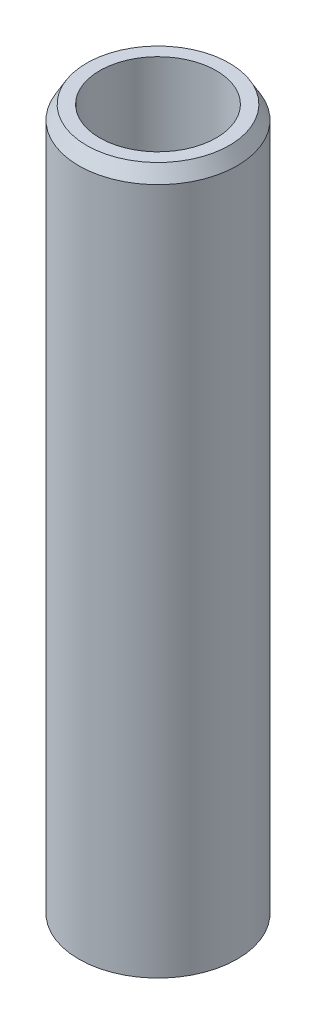
ISO-10303-21;
HEADER;
FILE_DESCRIPTION(('STEP AP214'),'2;1');
FILE_NAME('part.step','',(''),(''),'','','');
FILE_SCHEMA(('AUTOMOTIVE_DESIGN { 1 0 10303 214 1 1 1 1 }'));
ENDSEC;
DATA;
#1=APPLICATION_CONTEXT('core data for automotive mechanical design processes');
#2=APPLICATION_PROTOCOL_DEFINITION('international standard','automotive_design',2000,#1);
#3=PRODUCT_CONTEXT('',#1,'mechanical');
#4=PRODUCT('Part','Part','',(#3));
#5=PRODUCT_RELATED_PRODUCT_CATEGORY('part','',(#4));
#6=PRODUCT_DEFINITION_FORMATION('','',#4);
#7=PRODUCT_DEFINITION_CONTEXT('part definition',#1,'design');
#8=PRODUCT_DEFINITION('design','',#6,#7);
#9=PRODUCT_DEFINITION_SHAPE('','',#8);
#10=(LENGTH_UNIT() NAMED_UNIT(*) SI_UNIT(.MILLI.,.METRE.));
#11=(NAMED_UNIT(*) PLANE_ANGLE_UNIT() SI_UNIT($,.RADIAN.));
#12=(NAMED_UNIT(*) SI_UNIT($,.STERADIAN.) SOLID_ANGLE_UNIT());
#13=UNCERTAINTY_MEASURE_WITH_UNIT(LENGTH_MEASURE(1.E-05),#10,'distance_accuracy_value','');
#14=(GEOMETRIC_REPRESENTATION_CONTEXT(3) GLOBAL_UNCERTAINTY_ASSIGNED_CONTEXT((#13)) GLOBAL_UNIT_ASSIGNED_CONTEXT((#10,
#11,#12)) REPRESENTATION_CONTEXT('',''));
#15=CARTESIAN_POINT('',(0.,0.,0.));
#16=DIRECTION('',(0.,0.,1.));
#17=DIRECTION('',(1.,0.,0.));
#18=AXIS2_PLACEMENT_3D('',#15,#16,#17);
#19=CARTESIAN_POINT('',(0.,178.879486771898,0.));
#20=DIRECTION('',(0.,-1.,0.));
#21=DIRECTION('',(0.,0.,-1.));
#22=AXIS2_PLACEMENT_3D('',#19,#20,#21);
#23=CYLINDRICAL_SURFACE('',#22,20.);
#24=CARTESIAN_POINT('',(0.,175.435859388087,0.));
#25=DIRECTION('',(0.,1.,0.));
#26=DIRECTION('',(0.,0.,1.));
#27=AXIS2_PLACEMENT_3D('',#24,#25,#26);
#28=CIRCLE('',#27,20.);
#29=CARTESIAN_POINT('',(0.,175.435859388087,20.));
#30=VERTEX_POINT('',#29);
#31=EDGE_CURVE('E50',#30,#30,#28,.F.);
#32=ORIENTED_EDGE('',*,*,#31,.T.);
#33=EDGE_LOOP('',(#32));
#34=FACE_BOUND('',#33,.T.);
#35=CARTESIAN_POINT('',(0.,1.98817919703231,0.));
#36=DIRECTION('',(0.,1.,0.));
#37=DIRECTION('',(0.,0.,1.));
#38=AXIS2_PLACEMENT_3D('',#35,#36,#37);
#39=CIRCLE('',#38,20.);
#40=CARTESIAN_POINT('',(0.,1.98817919703231,20.));
#41=VERTEX_POINT('',#40);
#42=EDGE_CURVE('E51',#41,#41,#39,.T.);
#43=ORIENTED_EDGE('',*,*,#42,.T.);
#44=EDGE_LOOP('',(#43));
#45=FACE_BOUND('',#44,.T.);
#46=ADVANCED_FACE('F39',(#34,#45),#23,.T.);
#47=CARTESIAN_POINT('',(0.,178.879486771898,0.));
#48=DIRECTION('',(0.,1.,0.));
#49=DIRECTION('',(0.,0.,1.));
#50=AXIS2_PLACEMENT_3D('',#47,#48,#49);
#51=PLANE('',#50);
#52=CARTESIAN_POINT('',(0.,178.879486771898,0.));
#53=DIRECTION('',(0.,1.,0.));
#54=DIRECTION('',(0.,0.,1.));
#55=AXIS2_PLACEMENT_3D('',#52,#53,#54);
#56=CIRCLE('',#55,18.0118208029677);
#57=CARTESIAN_POINT('',(0.,178.879486771898,18.0118208029677));
#58=VERTEX_POINT('',#57);
#59=EDGE_CURVE('E54',#58,#58,#56,.T.);
#60=ORIENTED_EDGE('',*,*,#59,.T.);
#61=EDGE_LOOP('',(#60));
#62=FACE_BOUND('',#61,.T.);
#63=CARTESIAN_POINT('',(0.,178.879486771898,0.));
#64=DIRECTION('',(0.,1.,0.));
#65=DIRECTION('',(0.,0.,1.));
#66=AXIS2_PLACEMENT_3D('',#63,#64,#65);
#67=CIRCLE('',#66,14.7159467450647);
#68=CARTESIAN_POINT('',(0.,178.879486771898,14.7159467450647));
#69=VERTEX_POINT('',#68);
#70=EDGE_CURVE('E58',#69,#69,#67,.T.);
#71=ORIENTED_EDGE('',*,*,#70,.F.);
#72=EDGE_LOOP('',(#71));
#73=FACE_BOUND('',#72,.T.);
#74=ADVANCED_FACE('F69',(#62,#73),#51,.T.);
#75=CARTESIAN_POINT('',(0.,0.,0.));
#76=DIRECTION('',(0.,1.,0.));
#77=DIRECTION('',(0.,0.,1.));
#78=AXIS2_PLACEMENT_3D('',#75,#76,#77);
#79=PLANE('',#78);
#80=CARTESIAN_POINT('',(0.,0.,0.));
#81=DIRECTION('',(0.,1.,0.));
#82=DIRECTION('',(0.,0.,1.));
#83=AXIS2_PLACEMENT_3D('',#80,#81,#82);
#84=CIRCLE('',#83,16.5563726161886);
#85=CARTESIAN_POINT('',(0.,0.,16.5563726161886));
#86=VERTEX_POINT('',#85);
#87=EDGE_CURVE('E10',#86,#86,#84,.F.);
#88=ORIENTED_EDGE('',*,*,#87,.T.);
#89=EDGE_LOOP('',(#88));
#90=FACE_BOUND('',#89,.T.);
#91=CARTESIAN_POINT('',(0.,0.,0.));
#92=DIRECTION('',(0.,1.,0.));
#93=DIRECTION('',(0.,0.,1.));
#94=AXIS2_PLACEMENT_3D('',#91,#92,#93);
#95=CIRCLE('',#94,14.7159467450647);
#96=CARTESIAN_POINT('',(0.,0.,14.7159467450647));
#97=VERTEX_POINT('',#96);
#98=EDGE_CURVE('E63',#97,#97,#95,.T.);
#99=ORIENTED_EDGE('',*,*,#98,.T.);
#100=EDGE_LOOP('',(#99));
#101=FACE_BOUND('',#100,.T.);
#102=ADVANCED_FACE('F75',(#90,#101),#79,.F.);
#103=CARTESIAN_POINT('',(0.,178.879486771898,0.));
#104=DIRECTION('',(0.,-1.,0.));
#105=DIRECTION('',(0.,0.,-1.));
#106=AXIS2_PLACEMENT_3D('',#103,#104,#105);
#107=CYLINDRICAL_SURFACE('',#106,14.7159467450647);
#108=ORIENTED_EDGE('',*,*,#70,.T.);
#109=EDGE_LOOP('',(#108));
#110=FACE_BOUND('',#109,.T.);
#111=ORIENTED_EDGE('',*,*,#98,.F.);
#112=EDGE_LOOP('',(#111));
#113=FACE_BOUND('',#112,.T.);
#114=ADVANCED_FACE('F70',(#110,#113),#107,.F.);
#115=CARTESIAN_POINT('',(0.,178.879486771898,0.));
#116=DIRECTION('',(0.,-1.,0.));
#117=DIRECTION('',(0.,0.,-1.));
#118=AXIS2_PLACEMENT_3D('',#115,#116,#117);
#119=CONICAL_SURFACE('',#118,18.0118208029677,0.523598775598296);
#120=ORIENTED_EDGE('',*,*,#31,.F.);
#121=EDGE_LOOP('',(#120));
#122=FACE_BOUND('',#121,.T.);
#123=ORIENTED_EDGE('',*,*,#59,.F.);
#124=EDGE_LOOP('',(#123));
#125=FACE_BOUND('',#124,.T.);
#126=ADVANCED_FACE('F81',(#122,#125),#119,.T.);
#127=CARTESIAN_POINT('',(0.,1.98817919703231,0.));
#128=DIRECTION('',(0.,1.,0.));
#129=DIRECTION('',(0.,0.,1.));
#130=AXIS2_PLACEMENT_3D('',#127,#128,#129);
#131=CONICAL_SURFACE('',#130,20.,1.0471975511966);
#132=ORIENTED_EDGE('',*,*,#87,.F.);
#133=EDGE_LOOP('',(#132));
#134=FACE_BOUND('',#133,.T.);
#135=ORIENTED_EDGE('',*,*,#42,.F.);
#136=EDGE_LOOP('',(#135));
#137=FACE_BOUND('',#136,.T.);
#138=ADVANCED_FACE('F45',(#134,#137),#131,.T.);
#139=CLOSED_SHELL('',(#46,#74,#102,#114,#126,#138));
#140=MANIFOLD_SOLID_BREP('B2',#139);
#141=ADVANCED_BREP_SHAPE_REPRESENTATION('',(#18,#140),#14);
#142=SHAPE_DEFINITION_REPRESENTATION(#9,#141);
ENDSEC;
END-ISO-10303-21;
